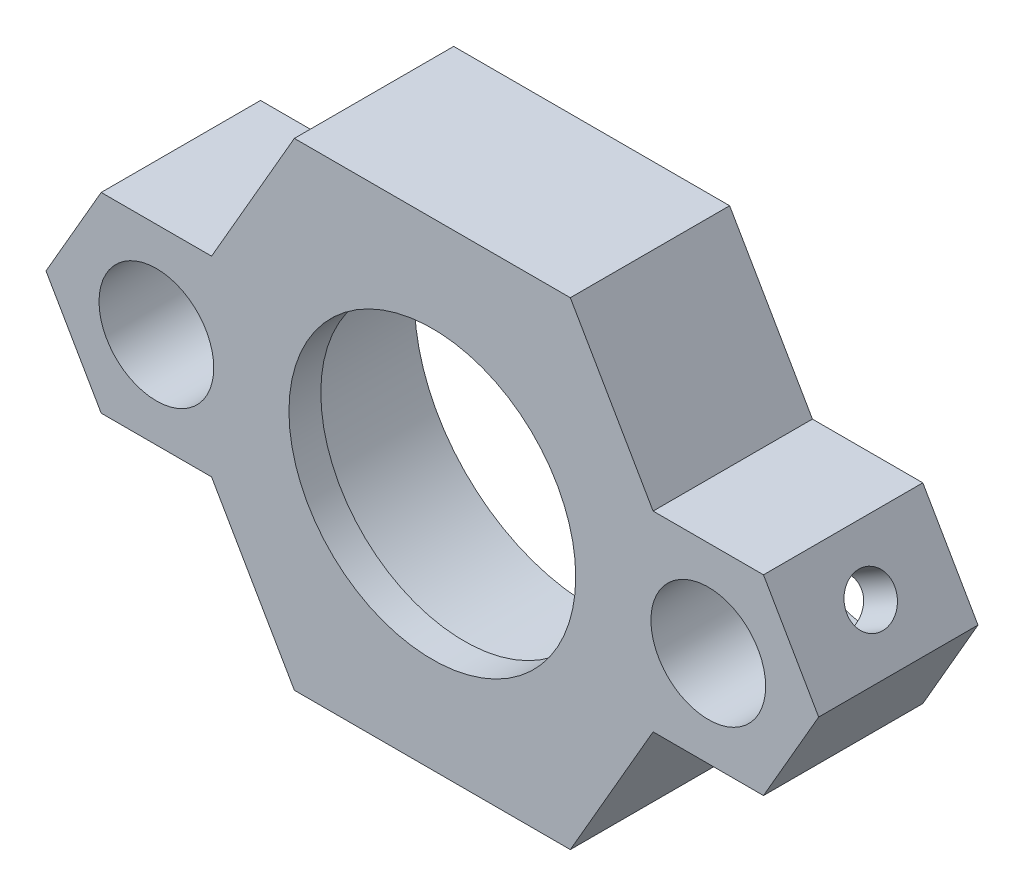
ISO-10303-21;
HEADER;
FILE_DESCRIPTION(('STEP AP214'),'2;1');
FILE_NAME('part.step','',(''),(''),'','','');
FILE_SCHEMA(('AUTOMOTIVE_DESIGN { 1 0 10303 214 1 1 1 1 }'));
ENDSEC;
DATA;
#1=APPLICATION_CONTEXT('core data for automotive mechanical design processes');
#2=APPLICATION_PROTOCOL_DEFINITION('international standard','automotive_design',2000,#1);
#3=PRODUCT_CONTEXT('',#1,'mechanical');
#4=PRODUCT('Part','Part','',(#3));
#5=PRODUCT_RELATED_PRODUCT_CATEGORY('part','',(#4));
#6=PRODUCT_DEFINITION_FORMATION('','',#4);
#7=PRODUCT_DEFINITION_CONTEXT('part definition',#1,'design');
#8=PRODUCT_DEFINITION('design','',#6,#7);
#9=PRODUCT_DEFINITION_SHAPE('','',#8);
#10=(LENGTH_UNIT() NAMED_UNIT(*) SI_UNIT(.MILLI.,.METRE.));
#11=(NAMED_UNIT(*) PLANE_ANGLE_UNIT() SI_UNIT($,.RADIAN.));
#12=(NAMED_UNIT(*) SI_UNIT($,.STERADIAN.) SOLID_ANGLE_UNIT());
#13=UNCERTAINTY_MEASURE_WITH_UNIT(LENGTH_MEASURE(1.E-05),#10,'distance_accuracy_value','');
#14=(GEOMETRIC_REPRESENTATION_CONTEXT(3) GLOBAL_UNCERTAINTY_ASSIGNED_CONTEXT((#13)) GLOBAL_UNIT_ASSIGNED_CONTEXT((#10,
#11,#12)) REPRESENTATION_CONTEXT('',''));
#15=CARTESIAN_POINT('',(0.,0.,0.));
#16=DIRECTION('',(0.,0.,1.));
#17=DIRECTION('',(1.,0.,0.));
#18=AXIS2_PLACEMENT_3D('',#15,#16,#17);
#19=CARTESIAN_POINT('',(0.,0.,0.));
#20=DIRECTION('',(0.,0.,1.));
#21=DIRECTION('',(1.,0.,0.));
#22=AXIS2_PLACEMENT_3D('',#19,#20,#21);
#23=PLANE('',#22);
#24=DIRECTION('',(-0.500000000000001,0.866025403784438,0.));
#25=VECTOR('',#24,1.);
#26=CARTESIAN_POINT('',(13.856406460551,5.99999999999999,0.));
#27=LINE('',#26,#25);
#28=CARTESIAN_POINT('',(13.856406460551,5.99999999999999,0.));
#29=VERTEX_POINT('',#28);
#30=CARTESIAN_POINT('',(8.66025403784438,15.,0.));
#31=VERTEX_POINT('',#30);
#32=EDGE_CURVE('E214',#29,#31,#27,.T.);
#33=ORIENTED_EDGE('',*,*,#32,.F.);
#34=DIRECTION('',(-1.,0.,0.));
#35=VECTOR('',#34,1.);
#36=CARTESIAN_POINT('',(20.7846096908265,5.99999999999999,0.));
#37=LINE('',#36,#35);
#38=CARTESIAN_POINT('',(20.7846096908265,5.99999999999999,0.));
#39=VERTEX_POINT('',#38);
#40=EDGE_CURVE('E54',#39,#29,#37,.T.);
#41=ORIENTED_EDGE('',*,*,#40,.F.);
#42=DIRECTION('',(-0.499999999999999,0.866025403784439,0.));
#43=VECTOR('',#42,1.);
#44=CARTESIAN_POINT('',(24.2487113059643,0.,0.));
#45=LINE('',#44,#43);
#46=CARTESIAN_POINT('',(24.2487113059643,0.,0.));
#47=VERTEX_POINT('',#46);
#48=EDGE_CURVE('E62',#47,#39,#45,.T.);
#49=ORIENTED_EDGE('',*,*,#48,.F.);
#50=DIRECTION('',(0.5,0.866025403784438,0.));
#51=VECTOR('',#50,1.);
#52=CARTESIAN_POINT('',(20.7846096908265,-6.00000000000001,0.));
#53=LINE('',#52,#51);
#54=CARTESIAN_POINT('',(20.7846096908265,-6.00000000000001,0.));
#55=VERTEX_POINT('',#54);
#56=EDGE_CURVE('E236',#55,#47,#53,.T.);
#57=ORIENTED_EDGE('',*,*,#56,.F.);
#58=DIRECTION('',(1.,0.,0.));
#59=VECTOR('',#58,1.);
#60=CARTESIAN_POINT('',(13.856406460551,-6.00000000000001,0.));
#61=LINE('',#60,#59);
#62=CARTESIAN_POINT('',(13.856406460551,-6.00000000000001,0.));
#63=VERTEX_POINT('',#62);
#64=EDGE_CURVE('E234',#63,#55,#61,.T.);
#65=ORIENTED_EDGE('',*,*,#64,.F.);
#66=DIRECTION('',(0.5,0.866025403784438,0.));
#67=VECTOR('',#66,1.);
#68=CARTESIAN_POINT('',(8.66025403784438,-15.,0.));
#69=LINE('',#68,#67);
#70=CARTESIAN_POINT('',(8.66025403784438,-15.,0.));
#71=VERTEX_POINT('',#70);
#72=EDGE_CURVE('E232',#71,#63,#69,.T.);
#73=ORIENTED_EDGE('',*,*,#72,.F.);
#74=DIRECTION('',(1.,0.,0.));
#75=VECTOR('',#74,1.);
#76=CARTESIAN_POINT('',(-8.66025403784438,-15.,0.));
#77=LINE('',#76,#75);
#78=CARTESIAN_POINT('',(-8.66025403784438,-15.,0.));
#79=VERTEX_POINT('',#78);
#80=EDGE_CURVE('E230',#79,#71,#77,.T.);
#81=ORIENTED_EDGE('',*,*,#80,.F.);
#82=DIRECTION('',(0.5,-0.866025403784439,0.));
#83=VECTOR('',#82,1.);
#84=CARTESIAN_POINT('',(-13.856406460551,-6.00000000000001,0.));
#85=LINE('',#84,#83);
#86=CARTESIAN_POINT('',(-13.856406460551,-6.00000000000001,0.));
#87=VERTEX_POINT('',#86);
#88=EDGE_CURVE('E228',#87,#79,#85,.T.);
#89=ORIENTED_EDGE('',*,*,#88,.F.);
#90=DIRECTION('',(1.,0.,0.));
#91=VECTOR('',#90,1.);
#92=CARTESIAN_POINT('',(-13.856406460551,-6.00000000000001,0.));
#93=LINE('',#92,#91);
#94=CARTESIAN_POINT('',(-20.7846096908265,-6.00000000000001,0.));
#95=VERTEX_POINT('',#94);
#96=EDGE_CURVE('E226',#95,#87,#93,.T.);
#97=ORIENTED_EDGE('',*,*,#96,.F.);
#98=DIRECTION('',(0.5,-0.866025403784438,0.));
#99=VECTOR('',#98,1.);
#100=CARTESIAN_POINT('',(-20.7846096908265,-6.00000000000001,0.));
#101=LINE('',#100,#99);
#102=CARTESIAN_POINT('',(-24.2487113059643,0.,0.));
#103=VERTEX_POINT('',#102);
#104=EDGE_CURVE('E224',#103,#95,#101,.T.);
#105=ORIENTED_EDGE('',*,*,#104,.F.);
#106=DIRECTION('',(-0.499999999999999,-0.866025403784439,0.));
#107=VECTOR('',#106,1.);
#108=CARTESIAN_POINT('',(-24.2487113059643,0.,0.));
#109=LINE('',#108,#107);
#110=CARTESIAN_POINT('',(-20.7846096908265,5.99999999999999,0.));
#111=VERTEX_POINT('',#110);
#112=EDGE_CURVE('E222',#111,#103,#109,.T.);
#113=ORIENTED_EDGE('',*,*,#112,.F.);
#114=DIRECTION('',(-1.,0.,0.));
#115=VECTOR('',#114,1.);
#116=CARTESIAN_POINT('',(-20.7846096908265,5.99999999999999,0.));
#117=LINE('',#116,#115);
#118=CARTESIAN_POINT('',(-13.856406460551,5.99999999999999,0.));
#119=VERTEX_POINT('',#118);
#120=EDGE_CURVE('E220',#119,#111,#117,.T.);
#121=ORIENTED_EDGE('',*,*,#120,.F.);
#122=DIRECTION('',(-0.5,-0.866025403784438,0.));
#123=VECTOR('',#122,1.);
#124=CARTESIAN_POINT('',(-8.66025403784438,15.,0.));
#125=LINE('',#124,#123);
#126=CARTESIAN_POINT('',(-8.66025403784438,15.,0.));
#127=VERTEX_POINT('',#126);
#128=EDGE_CURVE('E218',#127,#119,#125,.T.);
#129=ORIENTED_EDGE('',*,*,#128,.F.);
#130=DIRECTION('',(-1.,0.,0.));
#131=VECTOR('',#130,1.);
#132=CARTESIAN_POINT('',(8.66025403784438,15.,0.));
#133=LINE('',#132,#131);
#134=EDGE_CURVE('E145',#31,#127,#133,.T.);
#135=ORIENTED_EDGE('',*,*,#134,.F.);
#136=EDGE_LOOP('',(#33,#41,#49,#57,#65,#73,#81,#89,#97,#105,#113,#121,#129,#135));
#137=FACE_BOUND('',#136,.T.);
#138=CARTESIAN_POINT('',(0.,0.,0.));
#139=DIRECTION('',(0.,0.,1.));
#140=DIRECTION('',(1.,0.,0.));
#141=AXIS2_PLACEMENT_3D('',#138,#139,#140);
#142=CIRCLE('',#141,11.125);
#143=CARTESIAN_POINT('',(11.125,0.,0.));
#144=VERTEX_POINT('',#143);
#145=EDGE_CURVE('E209',#144,#144,#142,.T.);
#146=ORIENTED_EDGE('',*,*,#145,.T.);
#147=EDGE_LOOP('',(#146));
#148=FACE_BOUND('',#147,.T.);
#149=CARTESIAN_POINT('',(17.3205080756888,0.,0.));
#150=DIRECTION('',(0.,0.,1.));
#151=DIRECTION('',(1.,0.,0.));
#152=AXIS2_PLACEMENT_3D('',#149,#150,#151);
#153=CIRCLE('',#152,3.6);
#154=CARTESIAN_POINT('',(20.9205080756888,0.,0.));
#155=VERTEX_POINT('',#154);
#156=EDGE_CURVE('E206',#155,#155,#153,.T.);
#157=ORIENTED_EDGE('',*,*,#156,.T.);
#158=EDGE_LOOP('',(#157));
#159=FACE_BOUND('',#158,.T.);
#160=CARTESIAN_POINT('',(-17.3205080756888,0.,0.));
#161=DIRECTION('',(0.,0.,1.));
#162=DIRECTION('',(-1.,0.,0.));
#163=AXIS2_PLACEMENT_3D('',#160,#161,#162);
#164=CIRCLE('',#163,3.6);
#165=CARTESIAN_POINT('',(-20.9205080756888,0.,0.));
#166=VERTEX_POINT('',#165);
#167=EDGE_CURVE('E203',#166,#166,#164,.T.);
#168=ORIENTED_EDGE('',*,*,#167,.T.);
#169=EDGE_LOOP('',(#168));
#170=FACE_BOUND('',#169,.T.);
#171=ADVANCED_FACE('F39',(#137,#148,#159,#170),#23,.F.);
#172=CARTESIAN_POINT('',(13.856406460551,5.99999999999999,8.));
#173=DIRECTION('',(-0.866025403784438,-0.500000000000001,0.));
#174=DIRECTION('',(0.500000000000001,-0.866025403784438,0.));
#175=AXIS2_PLACEMENT_3D('',#172,#173,#174);
#176=PLANE('',#175);
#177=ORIENTED_EDGE('',*,*,#32,.T.);
#178=DIRECTION('',(0.,0.,-1.));
#179=VECTOR('',#178,1.);
#180=CARTESIAN_POINT('',(8.66025403784438,15.,8.));
#181=LINE('',#180,#179);
#182=CARTESIAN_POINT('',(8.66025403784438,15.,10.));
#183=VERTEX_POINT('',#182);
#184=EDGE_CURVE('E11',#183,#31,#181,.T.);
#185=ORIENTED_EDGE('',*,*,#184,.F.);
#186=DIRECTION('',(-0.500000000000001,0.866025403784438,0.));
#187=VECTOR('',#186,1.);
#188=CARTESIAN_POINT('',(13.856406460551,5.99999999999999,10.));
#189=LINE('',#188,#187);
#190=CARTESIAN_POINT('',(13.856406460551,5.99999999999999,10.));
#191=VERTEX_POINT('',#190);
#192=EDGE_CURVE('E163',#191,#183,#189,.T.);
#193=ORIENTED_EDGE('',*,*,#192,.F.);
#194=DIRECTION('',(0.,0.,-1.));
#195=VECTOR('',#194,1.);
#196=CARTESIAN_POINT('',(13.856406460551,5.99999999999999,8.));
#197=LINE('',#196,#195);
#198=EDGE_CURVE('E240',#191,#29,#197,.T.);
#199=ORIENTED_EDGE('',*,*,#198,.T.);
#200=EDGE_LOOP('',(#177,#185,#193,#199));
#201=FACE_BOUND('',#200,.T.);
#202=ADVANCED_FACE('F41',(#201),#176,.F.);
#203=CARTESIAN_POINT('',(8.66025403784438,15.,8.));
#204=DIRECTION('',(0.,-1.,0.));
#205=DIRECTION('',(0.,0.,-1.));
#206=AXIS2_PLACEMENT_3D('',#203,#204,#205);
#207=PLANE('',#206);
#208=ORIENTED_EDGE('',*,*,#134,.T.);
#209=DIRECTION('',(0.,0.,-1.));
#210=VECTOR('',#209,1.);
#211=CARTESIAN_POINT('',(-8.66025403784438,15.,8.));
#212=LINE('',#211,#210);
#213=CARTESIAN_POINT('',(-8.66025403784438,15.,10.));
#214=VERTEX_POINT('',#213);
#215=EDGE_CURVE('E47',#214,#127,#212,.T.);
#216=ORIENTED_EDGE('',*,*,#215,.F.);
#217=DIRECTION('',(-1.,0.,0.));
#218=VECTOR('',#217,1.);
#219=CARTESIAN_POINT('',(8.66025403784438,15.,10.));
#220=LINE('',#219,#218);
#221=EDGE_CURVE('E144',#183,#214,#220,.T.);
#222=ORIENTED_EDGE('',*,*,#221,.F.);
#223=ORIENTED_EDGE('',*,*,#184,.T.);
#224=EDGE_LOOP('',(#208,#216,#222,#223));
#225=FACE_BOUND('',#224,.T.);
#226=ADVANCED_FACE('F142',(#225),#207,.F.);
#227=CARTESIAN_POINT('',(-8.66025403784438,15.,8.));
#228=DIRECTION('',(0.866025403784439,-0.5,0.));
#229=DIRECTION('',(0.5,0.866025403784438,0.));
#230=AXIS2_PLACEMENT_3D('',#227,#228,#229);
#231=PLANE('',#230);
#232=ORIENTED_EDGE('',*,*,#128,.T.);
#233=DIRECTION('',(0.,0.,-1.));
#234=VECTOR('',#233,1.);
#235=CARTESIAN_POINT('',(-13.856406460551,5.99999999999999,8.));
#236=LINE('',#235,#234);
#237=CARTESIAN_POINT('',(-13.856406460551,5.99999999999999,10.));
#238=VERTEX_POINT('',#237);
#239=EDGE_CURVE('E148',#238,#119,#236,.T.);
#240=ORIENTED_EDGE('',*,*,#239,.F.);
#241=DIRECTION('',(-0.5,-0.866025403784438,0.));
#242=VECTOR('',#241,1.);
#243=CARTESIAN_POINT('',(-8.66025403784438,15.,10.));
#244=LINE('',#243,#242);
#245=EDGE_CURVE('E150',#214,#238,#244,.T.);
#246=ORIENTED_EDGE('',*,*,#245,.F.);
#247=ORIENTED_EDGE('',*,*,#215,.T.);
#248=EDGE_LOOP('',(#232,#240,#246,#247));
#249=FACE_BOUND('',#248,.T.);
#250=ADVANCED_FACE('F151',(#249),#231,.F.);
#251=CARTESIAN_POINT('',(-20.7846096908265,5.99999999999999,8.));
#252=DIRECTION('',(0.,-1.,0.));
#253=DIRECTION('',(1.,0.,0.));
#254=AXIS2_PLACEMENT_3D('',#251,#252,#253);
#255=PLANE('',#254);
#256=ORIENTED_EDGE('',*,*,#120,.T.);
#257=DIRECTION('',(0.,0.,-1.));
#258=VECTOR('',#257,1.);
#259=CARTESIAN_POINT('',(-20.7846096908265,5.99999999999999,8.));
#260=LINE('',#259,#258);
#261=CARTESIAN_POINT('',(-20.7846096908265,5.99999999999999,10.));
#262=VERTEX_POINT('',#261);
#263=EDGE_CURVE('E267',#262,#111,#260,.T.);
#264=ORIENTED_EDGE('',*,*,#263,.F.);
#265=DIRECTION('',(-1.,0.,0.));
#266=VECTOR('',#265,1.);
#267=CARTESIAN_POINT('',(-13.856406460551,5.99999999999999,10.));
#268=LINE('',#267,#266);
#269=EDGE_CURVE('E156',#238,#262,#268,.T.);
#270=ORIENTED_EDGE('',*,*,#269,.F.);
#271=ORIENTED_EDGE('',*,*,#239,.T.);
#272=EDGE_LOOP('',(#256,#264,#270,#271));
#273=FACE_BOUND('',#272,.T.);
#274=ADVANCED_FACE('F272',(#273),#255,.F.);
#275=CARTESIAN_POINT('',(-24.2487113059643,0.,8.));
#276=DIRECTION('',(0.866025403784439,-0.499999999999999,0.));
#277=DIRECTION('',(0.499999999999999,0.866025403784439,0.));
#278=AXIS2_PLACEMENT_3D('',#275,#276,#277);
#279=PLANE('',#278);
#280=CARTESIAN_POINT('',(-22.5166604983954,2.99999999999999,5.));
#281=DIRECTION('',(-0.866025403784439,0.499999999999999,0.));
#282=DIRECTION('',(-0.499999999999999,-0.866025403784439,0.));
#283=AXIS2_PLACEMENT_3D('',#280,#281,#282);
#284=CIRCLE('',#283,1.5);
#285=CARTESIAN_POINT('',(-23.2666604983954,1.70096189432334,5.));
#286=VERTEX_POINT('',#285);
#287=EDGE_CURVE('E369',#286,#286,#284,.T.);
#288=ORIENTED_EDGE('',*,*,#287,.F.);
#289=EDGE_LOOP('',(#288));
#290=FACE_BOUND('',#289,.T.);
#291=ORIENTED_EDGE('',*,*,#112,.T.);
#292=DIRECTION('',(0.,0.,-1.));
#293=VECTOR('',#292,1.);
#294=CARTESIAN_POINT('',(-24.2487113059643,0.,8.));
#295=LINE('',#294,#293);
#296=CARTESIAN_POINT('',(-24.2487113059643,0.,10.));
#297=VERTEX_POINT('',#296);
#298=EDGE_CURVE('E264',#297,#103,#295,.T.);
#299=ORIENTED_EDGE('',*,*,#298,.F.);
#300=DIRECTION('',(-0.499999999999999,-0.866025403784439,0.));
#301=VECTOR('',#300,1.);
#302=CARTESIAN_POINT('',(-20.7846096908265,5.99999999999999,10.));
#303=LINE('',#302,#301);
#304=EDGE_CURVE('E172',#262,#297,#303,.T.);
#305=ORIENTED_EDGE('',*,*,#304,.F.);
#306=ORIENTED_EDGE('',*,*,#263,.T.);
#307=EDGE_LOOP('',(#291,#299,#305,#306));
#308=FACE_BOUND('',#307,.T.);
#309=ADVANCED_FACE('F280',(#290,#308),#279,.F.);
#310=CARTESIAN_POINT('',(-20.7846096908265,-6.00000000000001,8.));
#311=DIRECTION('',(0.866025403784438,0.5,0.));
#312=DIRECTION('',(-0.5,0.866025403784438,0.));
#313=AXIS2_PLACEMENT_3D('',#310,#311,#312);
#314=PLANE('',#313);
#315=ORIENTED_EDGE('',*,*,#104,.T.);
#316=DIRECTION('',(0.,0.,-1.));
#317=VECTOR('',#316,1.);
#318=CARTESIAN_POINT('',(-20.7846096908265,-6.00000000000001,8.));
#319=LINE('',#318,#317);
#320=CARTESIAN_POINT('',(-20.7846096908265,-6.00000000000001,10.));
#321=VERTEX_POINT('',#320);
#322=EDGE_CURVE('E261',#321,#95,#319,.T.);
#323=ORIENTED_EDGE('',*,*,#322,.F.);
#324=DIRECTION('',(0.5,-0.866025403784438,0.));
#325=VECTOR('',#324,1.);
#326=CARTESIAN_POINT('',(-24.2487113059643,0.,10.));
#327=LINE('',#326,#325);
#328=EDGE_CURVE('E175',#297,#321,#327,.T.);
#329=ORIENTED_EDGE('',*,*,#328,.F.);
#330=ORIENTED_EDGE('',*,*,#298,.T.);
#331=EDGE_LOOP('',(#315,#323,#329,#330));
#332=FACE_BOUND('',#331,.T.);
#333=ADVANCED_FACE('F284',(#332),#314,.F.);
#334=CARTESIAN_POINT('',(-13.856406460551,-6.00000000000001,8.));
#335=DIRECTION('',(0.,1.,0.));
#336=DIRECTION('',(-1.,0.,0.));
#337=AXIS2_PLACEMENT_3D('',#334,#335,#336);
#338=PLANE('',#337);
#339=ORIENTED_EDGE('',*,*,#96,.T.);
#340=DIRECTION('',(0.,0.,-1.));
#341=VECTOR('',#340,1.);
#342=CARTESIAN_POINT('',(-13.856406460551,-6.00000000000001,8.));
#343=LINE('',#342,#341);
#344=CARTESIAN_POINT('',(-13.856406460551,-6.00000000000001,10.));
#345=VERTEX_POINT('',#344);
#346=EDGE_CURVE('E258',#345,#87,#343,.T.);
#347=ORIENTED_EDGE('',*,*,#346,.F.);
#348=DIRECTION('',(1.,0.,0.));
#349=VECTOR('',#348,1.);
#350=CARTESIAN_POINT('',(-20.7846096908265,-6.00000000000001,10.));
#351=LINE('',#350,#349);
#352=EDGE_CURVE('E178',#321,#345,#351,.T.);
#353=ORIENTED_EDGE('',*,*,#352,.F.);
#354=ORIENTED_EDGE('',*,*,#322,.T.);
#355=EDGE_LOOP('',(#339,#347,#353,#354));
#356=FACE_BOUND('',#355,.T.);
#357=ADVANCED_FACE('F288',(#356),#338,.F.);
#358=CARTESIAN_POINT('',(-13.856406460551,-6.00000000000001,8.));
#359=DIRECTION('',(0.866025403784439,0.5,0.));
#360=DIRECTION('',(-0.5,0.866025403784439,0.));
#361=AXIS2_PLACEMENT_3D('',#358,#359,#360);
#362=PLANE('',#361);
#363=ORIENTED_EDGE('',*,*,#88,.T.);
#364=DIRECTION('',(0.,0.,-1.));
#365=VECTOR('',#364,1.);
#366=CARTESIAN_POINT('',(-8.66025403784438,-15.,8.));
#367=LINE('',#366,#365);
#368=CARTESIAN_POINT('',(-8.66025403784438,-15.,10.));
#369=VERTEX_POINT('',#368);
#370=EDGE_CURVE('E255',#369,#79,#367,.T.);
#371=ORIENTED_EDGE('',*,*,#370,.F.);
#372=DIRECTION('',(0.5,-0.866025403784439,0.));
#373=VECTOR('',#372,1.);
#374=CARTESIAN_POINT('',(-13.856406460551,-6.00000000000001,10.));
#375=LINE('',#374,#373);
#376=EDGE_CURVE('E181',#345,#369,#375,.T.);
#377=ORIENTED_EDGE('',*,*,#376,.F.);
#378=ORIENTED_EDGE('',*,*,#346,.T.);
#379=EDGE_LOOP('',(#363,#371,#377,#378));
#380=FACE_BOUND('',#379,.T.);
#381=ADVANCED_FACE('F291',(#380),#362,.F.);
#382=CARTESIAN_POINT('',(-8.66025403784438,-15.,8.));
#383=DIRECTION('',(0.,1.,0.));
#384=DIRECTION('',(-1.,0.,0.));
#385=AXIS2_PLACEMENT_3D('',#382,#383,#384);
#386=PLANE('',#385);
#387=ORIENTED_EDGE('',*,*,#80,.T.);
#388=DIRECTION('',(0.,0.,-1.));
#389=VECTOR('',#388,1.);
#390=CARTESIAN_POINT('',(8.66025403784438,-15.,8.));
#391=LINE('',#390,#389);
#392=CARTESIAN_POINT('',(8.66025403784438,-15.,10.));
#393=VERTEX_POINT('',#392);
#394=EDGE_CURVE('E252',#393,#71,#391,.T.);
#395=ORIENTED_EDGE('',*,*,#394,.F.);
#396=DIRECTION('',(1.,0.,0.));
#397=VECTOR('',#396,1.);
#398=CARTESIAN_POINT('',(-8.66025403784438,-15.,10.));
#399=LINE('',#398,#397);
#400=EDGE_CURVE('E184',#369,#393,#399,.T.);
#401=ORIENTED_EDGE('',*,*,#400,.F.);
#402=ORIENTED_EDGE('',*,*,#370,.T.);
#403=EDGE_LOOP('',(#387,#395,#401,#402));
#404=FACE_BOUND('',#403,.T.);
#405=ADVANCED_FACE('F296',(#404),#386,.F.);
#406=CARTESIAN_POINT('',(8.66025403784438,-15.,8.));
#407=DIRECTION('',(-0.866025403784438,0.5,0.));
#408=DIRECTION('',(-0.5,-0.866025403784439,0.));
#409=AXIS2_PLACEMENT_3D('',#406,#407,#408);
#410=PLANE('',#409);
#411=ORIENTED_EDGE('',*,*,#72,.T.);
#412=DIRECTION('',(0.,0.,-1.));
#413=VECTOR('',#412,1.);
#414=CARTESIAN_POINT('',(13.856406460551,-6.00000000000001,8.));
#415=LINE('',#414,#413);
#416=CARTESIAN_POINT('',(13.856406460551,-6.00000000000001,10.));
#417=VERTEX_POINT('',#416);
#418=EDGE_CURVE('E249',#417,#63,#415,.T.);
#419=ORIENTED_EDGE('',*,*,#418,.F.);
#420=DIRECTION('',(0.5,0.866025403784438,0.));
#421=VECTOR('',#420,1.);
#422=CARTESIAN_POINT('',(8.66025403784438,-15.,10.));
#423=LINE('',#422,#421);
#424=EDGE_CURVE('E187',#393,#417,#423,.T.);
#425=ORIENTED_EDGE('',*,*,#424,.F.);
#426=ORIENTED_EDGE('',*,*,#394,.T.);
#427=EDGE_LOOP('',(#411,#419,#425,#426));
#428=FACE_BOUND('',#427,.T.);
#429=ADVANCED_FACE('F300',(#428),#410,.F.);
#430=CARTESIAN_POINT('',(13.856406460551,-6.00000000000001,8.));
#431=DIRECTION('',(0.,1.,0.));
#432=DIRECTION('',(-1.,0.,0.));
#433=AXIS2_PLACEMENT_3D('',#430,#431,#432);
#434=PLANE('',#433);
#435=ORIENTED_EDGE('',*,*,#64,.T.);
#436=DIRECTION('',(0.,0.,-1.));
#437=VECTOR('',#436,1.);
#438=CARTESIAN_POINT('',(20.7846096908265,-6.00000000000001,8.));
#439=LINE('',#438,#437);
#440=CARTESIAN_POINT('',(20.7846096908265,-6.00000000000001,10.));
#441=VERTEX_POINT('',#440);
#442=EDGE_CURVE('E246',#441,#55,#439,.T.);
#443=ORIENTED_EDGE('',*,*,#442,.F.);
#444=DIRECTION('',(1.,0.,0.));
#445=VECTOR('',#444,1.);
#446=CARTESIAN_POINT('',(13.856406460551,-6.00000000000001,10.));
#447=LINE('',#446,#445);
#448=EDGE_CURVE('E190',#417,#441,#447,.T.);
#449=ORIENTED_EDGE('',*,*,#448,.F.);
#450=ORIENTED_EDGE('',*,*,#418,.T.);
#451=EDGE_LOOP('',(#435,#443,#449,#450));
#452=FACE_BOUND('',#451,.T.);
#453=ADVANCED_FACE('F304',(#452),#434,.F.);
#454=CARTESIAN_POINT('',(20.7846096908265,-6.00000000000001,8.));
#455=DIRECTION('',(-0.866025403784438,0.5,0.));
#456=DIRECTION('',(-0.5,-0.866025403784438,0.));
#457=AXIS2_PLACEMENT_3D('',#454,#455,#456);
#458=PLANE('',#457);
#459=ORIENTED_EDGE('',*,*,#56,.T.);
#460=DIRECTION('',(0.,0.,-1.));
#461=VECTOR('',#460,1.);
#462=CARTESIAN_POINT('',(24.2487113059643,0.,8.));
#463=LINE('',#462,#461);
#464=CARTESIAN_POINT('',(24.2487113059643,0.,10.));
#465=VERTEX_POINT('',#464);
#466=EDGE_CURVE('E244',#465,#47,#463,.T.);
#467=ORIENTED_EDGE('',*,*,#466,.F.);
#468=DIRECTION('',(0.5,0.866025403784438,0.));
#469=VECTOR('',#468,1.);
#470=CARTESIAN_POINT('',(20.7846096908265,-6.00000000000001,10.));
#471=LINE('',#470,#469);
#472=EDGE_CURVE('E193',#441,#465,#471,.T.);
#473=ORIENTED_EDGE('',*,*,#472,.F.);
#474=ORIENTED_EDGE('',*,*,#442,.T.);
#475=EDGE_LOOP('',(#459,#467,#473,#474));
#476=FACE_BOUND('',#475,.T.);
#477=ADVANCED_FACE('F307',(#476),#458,.F.);
#478=CARTESIAN_POINT('',(24.2487113059643,0.,8.));
#479=DIRECTION('',(-0.866025403784439,-0.499999999999999,0.));
#480=DIRECTION('',(0.499999999999999,-0.866025403784439,0.));
#481=AXIS2_PLACEMENT_3D('',#478,#479,#480);
#482=PLANE('',#481);
#483=CARTESIAN_POINT('',(22.5166604983954,2.99999999999999,5.));
#484=DIRECTION('',(0.866025403784439,0.499999999999999,0.));
#485=DIRECTION('',(-0.499999999999999,0.866025403784439,0.));
#486=AXIS2_PLACEMENT_3D('',#483,#484,#485);
#487=CIRCLE('',#486,1.5);
#488=CARTESIAN_POINT('',(21.7666604983954,4.29903810567665,5.));
#489=VERTEX_POINT('',#488);
#490=EDGE_CURVE('E401',#489,#489,#487,.T.);
#491=ORIENTED_EDGE('',*,*,#490,.F.);
#492=EDGE_LOOP('',(#491));
#493=FACE_BOUND('',#492,.T.);
#494=ORIENTED_EDGE('',*,*,#48,.T.);
#495=DIRECTION('',(0.,0.,-1.));
#496=VECTOR('',#495,1.);
#497=CARTESIAN_POINT('',(20.7846096908265,5.99999999999999,8.));
#498=LINE('',#497,#496);
#499=CARTESIAN_POINT('',(20.7846096908265,5.99999999999999,10.));
#500=VERTEX_POINT('',#499);
#501=EDGE_CURVE('E242',#500,#39,#498,.T.);
#502=ORIENTED_EDGE('',*,*,#501,.F.);
#503=DIRECTION('',(-0.499999999999999,0.866025403784439,0.));
#504=VECTOR('',#503,1.);
#505=CARTESIAN_POINT('',(24.2487113059643,0.,10.));
#506=LINE('',#505,#504);
#507=EDGE_CURVE('E196',#465,#500,#506,.T.);
#508=ORIENTED_EDGE('',*,*,#507,.F.);
#509=ORIENTED_EDGE('',*,*,#466,.T.);
#510=EDGE_LOOP('',(#494,#502,#508,#509));
#511=FACE_BOUND('',#510,.T.);
#512=ADVANCED_FACE('F312',(#493,#511),#482,.F.);
#513=CARTESIAN_POINT('',(20.7846096908265,5.99999999999999,8.));
#514=DIRECTION('',(0.,-1.,0.));
#515=DIRECTION('',(1.,0.,0.));
#516=AXIS2_PLACEMENT_3D('',#513,#514,#515);
#517=PLANE('',#516);
#518=ORIENTED_EDGE('',*,*,#40,.T.);
#519=ORIENTED_EDGE('',*,*,#198,.F.);
#520=DIRECTION('',(-1.,0.,0.));
#521=VECTOR('',#520,1.);
#522=CARTESIAN_POINT('',(20.7846096908265,5.99999999999999,10.));
#523=LINE('',#522,#521);
#524=EDGE_CURVE('E199',#500,#191,#523,.T.);
#525=ORIENTED_EDGE('',*,*,#524,.F.);
#526=ORIENTED_EDGE('',*,*,#501,.T.);
#527=EDGE_LOOP('',(#518,#519,#525,#526));
#528=FACE_BOUND('',#527,.T.);
#529=ADVANCED_FACE('F310',(#528),#517,.F.);
#530=CARTESIAN_POINT('',(0.,0.,8.));
#531=DIRECTION('',(0.,0.,-1.));
#532=DIRECTION('',(-1.,0.,0.));
#533=AXIS2_PLACEMENT_3D('',#530,#531,#532);
#534=CYLINDRICAL_SURFACE('',#533,11.125);
#535=CARTESIAN_POINT('',(0.,0.,8.));
#536=DIRECTION('',(0.,0.,1.));
#537=DIRECTION('',(1.,0.,0.));
#538=AXIS2_PLACEMENT_3D('',#535,#536,#537);
#539=CIRCLE('',#538,11.125);
#540=CARTESIAN_POINT('',(11.125,0.,8.));
#541=VERTEX_POINT('',#540);
#542=EDGE_CURVE('E202',#541,#541,#539,.T.);
#543=ORIENTED_EDGE('',*,*,#542,.T.);
#544=EDGE_LOOP('',(#543));
#545=FACE_BOUND('',#544,.T.);
#546=ORIENTED_EDGE('',*,*,#145,.F.);
#547=EDGE_LOOP('',(#546));
#548=FACE_BOUND('',#547,.T.);
#549=ADVANCED_FACE('F321',(#545,#548),#534,.F.);
#550=CARTESIAN_POINT('',(17.3205080756888,0.,8.));
#551=DIRECTION('',(0.,0.,-1.));
#552=DIRECTION('',(-1.,0.,0.));
#553=AXIS2_PLACEMENT_3D('',#550,#551,#552);
#554=CYLINDRICAL_SURFACE('',#553,3.6);
#555=CARTESIAN_POINT('',(19.4046746198424,2.93534492287201,5.));
#556=CARTESIAN_POINT('',(19.4046865135801,2.93534152304987,5.08000626907623));
#557=CARTESIAN_POINT('',(19.4104732770715,2.9312547139798,5.16014318819146));
#558=CARTESIAN_POINT('',(19.4331699857263,2.91493424022066,5.31810433046857));
#559=CARTESIAN_POINT('',(19.4501101358762,2.90267845163436,5.39592167201029));
#560=CARTESIAN_POINT('',(19.493680940087,2.87020020702673,5.54667335562929));
#561=CARTESIAN_POINT('',(19.5202720720512,2.85001021514226,5.61962619645802));
#562=CARTESIAN_POINT('',(19.5813534885536,2.80180044243818,5.75931133949366));
#563=CARTESIAN_POINT('',(19.6158419042961,2.77378251365932,5.82604510811975));
#564=CARTESIAN_POINT('',(19.692917824325,2.70820408186695,5.95559086996817));
#565=CARTESIAN_POINT('',(19.7358525311344,2.67019431928779,6.01796907049291));
#566=CARTESIAN_POINT('',(19.8261431952515,2.58565575662187,6.13304026699707));
#567=CARTESIAN_POINT('',(19.8735008466593,2.53912368566198,6.18572952873562));
#568=CARTESIAN_POINT('',(19.9725019113497,2.43562484561053,6.28213943705514));
#569=CARTESIAN_POINT('',(20.0242421211449,2.37829302252327,6.32537195363882));
#570=CARTESIAN_POINT('',(20.1275346219379,2.25544388354407,6.39833122460673));
#571=CARTESIAN_POINT('',(20.1790869862492,2.18993021779625,6.42806397435706));
#572=CARTESIAN_POINT('',(20.2769282096657,2.05575062444912,6.47160735050809));
#573=CARTESIAN_POINT('',(20.323351369522,1.98742615497259,6.48616603388246));
#574=CARTESIAN_POINT('',(20.4119386782969,1.84660901487839,6.50136516939183));
#575=CARTESIAN_POINT('',(20.4541045478507,1.77411804694124,6.50201126705955));
#576=CARTESIAN_POINT('',(20.5303872711503,1.63180924649574,6.48975886288002));
#577=CARTESIAN_POINT('',(20.5648378053735,1.56209722324766,6.47768227936913));
#578=CARTESIAN_POINT('',(20.6281323800366,1.42318305452728,6.44173627683421));
#579=CARTESIAN_POINT('',(20.6569760069479,1.35398094702486,6.4178659884438));
#580=CARTESIAN_POINT('',(20.7093291875305,1.21710611446473,6.35872635092643));
#581=CARTESIAN_POINT('',(20.7327506461856,1.14947283117609,6.32328864455501));
#582=CARTESIAN_POINT('',(20.774021994892,1.01879556304895,6.24218509195959));
#583=CARTESIAN_POINT('',(20.7918699105334,0.955753210583621,6.19651563098602));
#584=CARTESIAN_POINT('',(20.823710073882,0.831836920601941,6.09250109551446));
#585=CARTESIAN_POINT('',(20.8373418615131,0.771429065721674,6.03348945046519));
#586=CARTESIAN_POINT('',(20.8599434251563,0.660026800972247,5.9063462711521));
#587=CARTESIAN_POINT('',(20.8689114040527,0.609036024680021,5.83821123404949));
#588=CARTESIAN_POINT('',(20.8834934815971,0.517086946868437,5.69192595600571));
#589=CARTESIAN_POINT('',(20.8889876646683,0.476513451476064,5.61352015310806));
#590=CARTESIAN_POINT('',(20.8972512656425,0.409935330678305,5.4506227460306));
#591=CARTESIAN_POINT('',(20.9000226327991,0.383920288682649,5.36613554207654));
#592=CARTESIAN_POINT('',(20.9035549730483,0.349369828344667,5.1993238293032));
#593=CARTESIAN_POINT('',(20.9044347159527,0.33980982919393,5.11721465328914));
#594=CARTESIAN_POINT('',(20.9048306785768,0.335618024535859,4.9526258211062));
#595=CARTESIAN_POINT('',(20.9043473700233,0.340981054434473,4.87014630296995));
#596=CARTESIAN_POINT('',(20.9019313961229,0.365427997894088,4.71272193748346));
#597=CARTESIAN_POINT('',(20.9000935034919,0.383611481410619,4.63763277585584));
#598=CARTESIAN_POINT('',(20.894613691788,0.431682608437607,4.49137844420255));
#599=CARTESIAN_POINT('',(20.890971350992,0.461572987659858,4.42021419580315));
#600=CARTESIAN_POINT('',(20.8810012357871,0.533144095276258,4.28046162757224));
#601=CARTESIAN_POINT('',(20.8745662665834,0.575270533168951,4.21211003046761));
#602=CARTESIAN_POINT('',(20.8581214713199,0.668993951009579,4.08271033700117));
#603=CARTESIAN_POINT('',(20.8481100965722,0.72059502904126,4.02166541995776));
#604=CARTESIAN_POINT('',(20.8226194329421,0.836052070301954,3.90343983813919));
#605=CARTESIAN_POINT('',(20.8067613587352,0.900563706721985,3.84697832005921));
#606=CARTESIAN_POINT('',(20.7688226207233,1.03638467593549,3.74543324962481));
#607=CARTESIAN_POINT('',(20.7467415011364,1.10769450638219,3.70035053112356));
#608=CARTESIAN_POINT('',(20.6956123795089,1.25488990299471,3.62289214946771));
#609=CARTESIAN_POINT('',(20.6665466876891,1.33078671525995,3.59054931045262));
#610=CARTESIAN_POINT('',(20.601354464052,1.48424351800683,3.54005984919868));
#611=CARTESIAN_POINT('',(20.5652321505064,1.56180249035195,3.52190477812872));
#612=CARTESIAN_POINT('',(20.4893057842579,1.71031820499062,3.50137024937563));
#613=CARTESIAN_POINT('',(20.4499355671103,1.78135749507651,3.49797680036364));
#614=CARTESIAN_POINT('',(20.3667436444262,1.92015378666622,3.50433576955273));
#615=CARTESIAN_POINT('',(20.3229227205039,1.98791136141483,3.51408588321544));
#616=CARTESIAN_POINT('',(20.2340324069382,2.1159494127494,3.54572728659039));
#617=CARTESIAN_POINT('',(20.1890624478103,2.17640986423326,3.56717561656346));
#618=CARTESIAN_POINT('',(20.0981223125493,2.29133901426033,3.62112109665096));
#619=CARTESIAN_POINT('',(20.0521519479689,2.34580657200758,3.65362034559789));
#620=CARTESIAN_POINT('',(19.9589030430036,2.45030567574453,3.73038743505736));
#621=CARTESIAN_POINT('',(19.9116592740093,2.5000254949463,3.77512076170879));
#622=CARTESIAN_POINT('',(19.8200020500504,2.59166692817482,3.87440861944627));
#623=CARTESIAN_POINT('',(19.7755896541078,2.63358563546301,3.9289667964881));
#624=CARTESIAN_POINT('',(19.6887678254211,2.71201007416254,4.05073379102528));
#625=CARTESIAN_POINT('',(19.6467003302267,2.74795337555652,4.11855081754535));
#626=CARTESIAN_POINT('',(19.5706110683424,2.81060055902559,4.26255048881624));
#627=CARTESIAN_POINT('',(19.5365938015373,2.83729927744353,4.33873777766977));
#628=CARTESIAN_POINT('',(19.4792514287234,2.88116821762577,4.4971326020273));
#629=CARTESIAN_POINT('',(19.4558695528104,2.89838913637671,4.57930539055185));
#630=CARTESIAN_POINT('',(19.4216469196094,2.92330004217297,4.7474474886208));
#631=CARTESIAN_POINT('',(19.410764101873,2.93102200034131,4.83340304872916));
#632=CARTESIAN_POINT('',(19.405314260585,2.93488927741035,4.94643022911426));
#633=CARTESIAN_POINT('',(19.4046706369104,2.9353460613922,4.97320778886564));
#634=CARTESIAN_POINT('',(19.4046746198424,2.93534492287201,5.));
#635=B_SPLINE_CURVE_WITH_KNOTS('',3,(#555,#556,#557,#558,#559,#560,#561,#562,#563,#564,#565,
#566,#567,#568,#569,#570,#571,#572,#573,#574,#575,#576,#577,#578,#579,#580,#581,#582,#583,#584,
#585,#586,#587,#588,#589,#590,#591,#592,#593,#594,#595,#596,#597,#598,#599,#600,#601,#602,#603,
#604,#605,#606,#607,#608,#609,#610,#611,#612,#613,#614,#615,#616,#617,#618,#619,#620,#621,#622,
#623,#624,#625,#626,#627,#628,#629,#630,#631,#632,#633,#634),.UNSPECIFIED.,.T.,.F.,(4,2,2,2,2,2,
2,2,2,2,2,2,2,2,2,2,2,2,2,2,2,2,2,2,2,2,2,2,2,2,2,2,2,2,2,2,2,2,2,4),(0.,0.23994205438262,
0.480536594210611,0.720156782582534,0.95972032626012,1.21280209716785,1.46598120551893,
1.73014171893509,1.9941848012987,2.24448727173543,2.49468817101517,2.72966208294112,
2.96465331842261,3.20322977568079,3.44189065226981,3.69737438213381,3.9529564852964,
4.21693854800067,4.48073148894683,4.72740933967569,4.97400183022139,5.20480681279431,
5.43566576296236,5.67630152181803,5.91704160954559,6.17737995282616,6.4377373685024,
6.69876127146714,6.95962961571609,7.20226362112864,7.44485508962297,7.67884098043786,
7.91287133558608,8.15747835394845,8.40217633258686,8.66352512289693,8.92501965767027,
9.18510150956239,9.44430557455395,9.52465650524048),.UNSPECIFIED.);
#636=CARTESIAN_POINT('',(19.4046746198424,2.93534492287201,5.));
#637=VERTEX_POINT('',#636);
#638=EDGE_CURVE('E394',#637,#637,#635,.T.);
#639=ORIENTED_EDGE('',*,*,#638,.T.);
#640=EDGE_LOOP('',(#639));
#641=FACE_BOUND('',#640,.T.);
#642=ORIENTED_EDGE('',*,*,#156,.F.);
#643=EDGE_LOOP('',(#642));
#644=FACE_BOUND('',#643,.T.);
#645=CARTESIAN_POINT('',(17.3205080756888,0.,10.));
#646=DIRECTION('',(0.,0.,1.));
#647=DIRECTION('',(1.,0.,0.));
#648=AXIS2_PLACEMENT_3D('',#645,#646,#647);
#649=CIRCLE('',#648,3.6);
#650=CARTESIAN_POINT('',(20.9205080756888,0.,10.));
#651=VERTEX_POINT('',#650);
#652=EDGE_CURVE('E368',#651,#651,#649,.T.);
#653=ORIENTED_EDGE('',*,*,#652,.T.);
#654=EDGE_LOOP('',(#653));
#655=FACE_BOUND('',#654,.T.);
#656=ADVANCED_FACE('F334',(#641,#644,#655),#554,.F.);
#657=CARTESIAN_POINT('',(-17.3205080756888,0.,8.));
#658=DIRECTION('',(0.,0.,-1.));
#659=DIRECTION('',(-1.,0.,0.));
#660=AXIS2_PLACEMENT_3D('',#657,#658,#659);
#661=CYLINDRICAL_SURFACE('',#660,3.6);
#662=CARTESIAN_POINT('',(-20.9046746198425,0.337268711518703,5.));
#663=CARTESIAN_POINT('',(-20.904677622379,0.337280711708763,5.08000626907623));
#664=CARTESIAN_POINT('',(-20.9040317236495,0.344335600433002,5.16014318819146));
#665=CARTESIAN_POINT('',(-20.9012461330997,0.37215176358994,5.31810433046857));
#666=CARTESIAN_POINT('',(-20.8991023839155,0.392950258256833,5.39592167201029));
#667=CARTESIAN_POINT('',(-20.8927608011204,0.446922803870477,5.54667335562929));
#668=CARTESIAN_POINT('',(-20.8885713212284,0.480046395609122,5.61962619645802));
#669=CARTESIAN_POINT('',(-20.8773611416071,0.557049340351333,5.75931133949367));
#670=CARTESIAN_POINT('',(-20.8703411113945,0.600926148910071,5.82604510811975));
#671=CARTESIAN_POINT('',(-20.8520864835364,0.700465069571321,5.95559086996817));
#672=CARTESIAN_POINT('',(-20.8406364169557,0.756652497661951,6.01796907049292));
#673=CARTESIAN_POINT('',(-20.8125692061462,0.877115787844841,6.13304026699707));
#674=CARTESIAN_POINT('',(-20.7959500763081,0.941394752507487,6.18572952873562));
#675=CARTESIAN_POINT('',(-20.7558179839065,1.07888160955682,6.28213943705514));
#676=CARTESIAN_POINT('',(-20.7320372735653,1.15235585718021,6.32537195363882));
#677=CARTESIAN_POINT('',(-20.6772930487728,1.30323435637703,6.39833122460673));
#678=CARTESIAN_POINT('',(-20.6463327320957,1.38063684636962,6.42806397435706));
#679=CARTESIAN_POINT('',(-20.5790504072959,1.53245962805926,6.47160735050809));
#680=CARTESIAN_POINT('',(-20.5430912609573,1.60682549855699,6.48616603388246));
#681=CARTESIAN_POINT('',(-20.4654336947349,1.75395292845604,6.50136516939183));
#682=CARTESIAN_POINT('',(-20.4237376097333,1.82671512663092,6.50201126705955));
#683=CARTESIAN_POINT('',(-20.3386359350152,1.96393230310093,6.48975886288002));
#684=CARTESIAN_POINT('',(-20.2954888190448,2.02862335253629,6.47768227936913));
#685=CARTESIAN_POINT('',(-20.2068329073189,2.15289514647641,6.44173627683421));
#686=CARTESIAN_POINT('',(-20.161323937682,2.21247551387005,6.4178659884438));
#687=CARTESIAN_POINT('',(-20.0689634458375,2.3262521145036,6.35872635092643));
#688=CARTESIAN_POINT('',(-20.0221020336957,2.38035233433691,6.32328864455501));
#689=CARTESIAN_POINT('',(-19.9295678741537,2.4814330048287,6.24218509195959));
#690=CARTESIAN_POINT('',(-19.8838955532251,2.52841092941143,6.19651563098602));
#691=CARTESIAN_POINT('',(-19.7925009798325,2.61794346472277,6.09250109551446));
#692=CARTESIAN_POINT('',(-19.7470021367336,2.65995286655042,6.03348945046519));
#693=CARTESIAN_POINT('',(-19.6618257272431,2.73522752720538,5.9063462711521));
#694=CARTESIAN_POINT('',(-19.6221504090635,2.76848941289641,5.83821123404949));
#695=CARTESIAN_POINT('',(-19.5498112105964,2.82709240139561,5.69192595600571));
#696=CARTESIAN_POINT('',(-19.5174206244018,2.85213725120449,5.61352015310807));
#697=CARTESIAN_POINT('',(-19.4638940809419,2.89258279997381,5.4506227460306));
#698=CARTESIAN_POINT('',(-19.4427500772714,2.90799039533247,5.36613554207655));
#699=CARTESIAN_POINT('',(-19.4145946710308,2.92832472189201,5.1993238293032));
#700=CARTESIAN_POINT('',(-19.4067553403584,2.93386660117146,5.11721465328914));
#701=CARTESIAN_POINT('',(-19.4033231123488,2.93630541719183,4.9526258211062));
#702=CARTESIAN_POINT('',(-19.4077259782055,2.93320534475734,4.87014630296995));
#703=CARTESIAN_POINT('',(-19.4276896653362,2.91888957825489,4.71272193748346));
#704=CARTESIAN_POINT('',(-19.4425180776753,2.90820617478878,4.63763277585584));
#705=CARTESIAN_POINT('',(-19.4814089890173,2.87942495513175,4.49137844420255));
#706=CARTESIAN_POINT('',(-19.5054736463545,2.86132540586207,4.42021419580315));
#707=CARTESIAN_POINT('',(-19.5624709861248,2.81690547900774,4.28046162757224));
#708=CARTESIAN_POINT('',(-19.595736066909,2.79026941325842,4.21211003046761));
#709=CARTESIAN_POINT('',(-19.6686805300568,2.72916609387994,4.08271033700118));
#710=CARTESIAN_POINT('',(-19.708362687121,2.69469545000573,4.02166541995776));
#711=CARTESIAN_POINT('',(-19.7956060860835,2.61489136711242,3.90343983813919));
#712=CARTESIAN_POINT('',(-19.8435457649595,2.5689020537841,3.84697832005921));
#713=CARTESIAN_POINT('',(-19.9422008056591,2.46813565827158,3.7454332496248));
#714=CARTESIAN_POINT('',(-19.9929163705721,2.41335793254196,3.70035053112356));
#715=CARTESIAN_POINT('',(-20.0948267625449,2.29548111603308,3.62289214946771));
#716=CARTESIAN_POINT('',(-20.1460224841229,2.23236108240595,3.59054931045263));
#717=CARTESIAN_POINT('',(-20.2463238618667,2.09917455923355,3.54005984919869));
#718=CARTESIAN_POINT('',(-20.2954307454362,2.02911223188707,3.52190477812872));
#719=CARTESIAN_POINT('',(-20.3860859440502,1.88910021257949,3.50137024937563));
#720=CARTESIAN_POINT('',(-20.4279226653576,1.81948495933418,3.49797680036364));
#721=CARTESIAN_POINT('',(-20.5065278184833,1.6780404951052,3.50433576955273));
#722=CARTESIAN_POINT('',(-20.5432971375533,1.60621167439692,3.51408588321544));
#723=CARTESIAN_POINT('',(-20.6097361858773,1.4652113790314,3.54572728659039));
#724=CARTESIAN_POINT('',(-20.6396114932226,1.39603602627753,3.56717561656346));
#725=CARTESIAN_POINT('',(-20.6936729891509,1.25981498390436,3.62112109665096));
#726=CARTESIAN_POINT('',(-20.7178580955519,1.1927697014829,3.65362034559789));
#727=CARTESIAN_POINT('',(-20.7617325215782,1.05976422903941,3.73038743505736));
#728=CARTESIAN_POINT('',(-20.7811692635813,0.993990015318882,3.77512076170879));
#729=CARTESIAN_POINT('',(-20.814704460817,0.868791814315936,3.87440861944627));
#730=CARTESIAN_POINT('',(-20.828800928251,0.809370197542548,3.9289667964881));
#731=CARTESIAN_POINT('',(-20.853307570099,0.69496806894714,4.05073379102529));
#732=CARTESIAN_POINT('',(-20.8634016346049,0.640564898738225,4.11855081754535));
#733=CARTESIAN_POINT('',(-20.8796110560225,0.543346073256638,4.26255048881623));
#734=CARTESIAN_POINT('',(-20.8857241910184,0.500536896827157,4.33873777766977));
#735=CARTESIAN_POINT('',(-20.8950446212464,0.428942475165927,4.4971326020273));
#736=CARTESIAN_POINT('',(-20.8982674364047,0.400082717261667,4.57930539055185));
#737=CARTESIAN_POINT('',(-20.902729597055,0.35798959462703,4.7474474886208));
#738=CARTESIAN_POINT('',(-20.9039756001276,0.344703818918443,4.83340304872916));
#739=CARTESIAN_POINT('',(-20.9045998396688,0.338050479381897,4.94643022911426));
#740=CARTESIAN_POINT('',(-20.9046736143638,0.33726469293829,4.97320778886564));
#741=CARTESIAN_POINT('',(-20.9046746198425,0.337268711518703,5.));
#742=B_SPLINE_CURVE_WITH_KNOTS('',3,(#662,#663,#664,#665,#666,#667,#668,#669,#670,#671,#672,
#673,#674,#675,#676,#677,#678,#679,#680,#681,#682,#683,#684,#685,#686,#687,#688,#689,#690,#691,
#692,#693,#694,#695,#696,#697,#698,#699,#700,#701,#702,#703,#704,#705,#706,#707,#708,#709,#710,
#711,#712,#713,#714,#715,#716,#717,#718,#719,#720,#721,#722,#723,#724,#725,#726,#727,#728,#729,
#730,#731,#732,#733,#734,#735,#736,#737,#738,#739,#740,#741),.UNSPECIFIED.,.T.,.F.,(4,2,2,2,2,2,
2,2,2,2,2,2,2,2,2,2,2,2,2,2,2,2,2,2,2,2,2,2,2,2,2,2,2,2,2,2,2,2,2,4),(0.,0.239942054382619,
0.480536594210612,0.720156782582535,0.959720326260122,1.21280209716785,1.46598120551893,
1.73014171893509,1.99418480129869,2.24448727173542,2.49468817101516,2.72966208294111,
2.9646533184226,3.20322977568079,3.44189065226981,3.69737438213381,3.95295648529639,
4.21693854800066,4.48073148894683,4.72740933967569,4.97400183022138,5.2048068127943,
5.43566576296236,5.67630152181803,5.91704160954558,6.17737995282617,6.4377373685024,
6.69876127146714,6.95962961571609,7.20226362112864,7.44485508962297,7.67884098043785,
7.91287133558607,8.15747835394845,8.40217633258686,8.66352512289693,8.92501965767027,
9.18510150956238,9.44430557455395,9.52465650524047),.UNSPECIFIED.);
#743=CARTESIAN_POINT('',(-20.9046746198425,0.337268711518703,5.));
#744=VERTEX_POINT('',#743);
#745=EDGE_CURVE('E361',#744,#744,#742,.T.);
#746=ORIENTED_EDGE('',*,*,#745,.T.);
#747=EDGE_LOOP('',(#746));
#748=FACE_BOUND('',#747,.T.);
#749=ORIENTED_EDGE('',*,*,#167,.F.);
#750=EDGE_LOOP('',(#749));
#751=FACE_BOUND('',#750,.T.);
#752=CARTESIAN_POINT('',(-17.3205080756888,0.,10.));
#753=DIRECTION('',(0.,0.,1.));
#754=DIRECTION('',(1.,0.,0.));
#755=AXIS2_PLACEMENT_3D('',#752,#753,#754);
#756=CIRCLE('',#755,3.6);
#757=CARTESIAN_POINT('',(-13.7205080756888,0.,10.));
#758=VERTEX_POINT('',#757);
#759=EDGE_CURVE('E373',#758,#758,#756,.T.);
#760=ORIENTED_EDGE('',*,*,#759,.T.);
#761=EDGE_LOOP('',(#760));
#762=FACE_BOUND('',#761,.T.);
#763=ADVANCED_FACE('F337',(#748,#751,#762),#661,.F.);
#764=CARTESIAN_POINT('',(0.,0.,8.));
#765=DIRECTION('',(0.,0.,1.));
#766=DIRECTION('',(1.,0.,0.));
#767=AXIS2_PLACEMENT_3D('',#764,#765,#766);
#768=PLANE('',#767);
#769=CARTESIAN_POINT('',(0.,0.,8.));
#770=DIRECTION('',(0.,0.,1.));
#771=DIRECTION('',(1.,0.,0.));
#772=AXIS2_PLACEMENT_3D('',#769,#770,#771);
#773=CIRCLE('',#772,9.);
#774=CARTESIAN_POINT('',(9.,0.,8.));
#775=VERTEX_POINT('',#774);
#776=EDGE_CURVE('E167',#775,#775,#773,.T.);
#777=ORIENTED_EDGE('',*,*,#776,.T.);
#778=EDGE_LOOP('',(#777));
#779=FACE_BOUND('',#778,.T.);
#780=ORIENTED_EDGE('',*,*,#542,.F.);
#781=EDGE_LOOP('',(#780));
#782=FACE_BOUND('',#781,.T.);
#783=ADVANCED_FACE('F341',(#779,#782),#768,.F.);
#784=CARTESIAN_POINT('',(0.,0.,10.));
#785=DIRECTION('',(0.,0.,1.));
#786=DIRECTION('',(1.,0.,0.));
#787=AXIS2_PLACEMENT_3D('',#784,#785,#786);
#788=PLANE('',#787);
#789=ORIENTED_EDGE('',*,*,#759,.F.);
#790=EDGE_LOOP('',(#789));
#791=FACE_BOUND('',#790,.T.);
#792=ORIENTED_EDGE('',*,*,#221,.T.);
#793=ORIENTED_EDGE('',*,*,#245,.T.);
#794=ORIENTED_EDGE('',*,*,#269,.T.);
#795=ORIENTED_EDGE('',*,*,#304,.T.);
#796=ORIENTED_EDGE('',*,*,#328,.T.);
#797=ORIENTED_EDGE('',*,*,#352,.T.);
#798=ORIENTED_EDGE('',*,*,#376,.T.);
#799=ORIENTED_EDGE('',*,*,#400,.T.);
#800=ORIENTED_EDGE('',*,*,#424,.T.);
#801=ORIENTED_EDGE('',*,*,#448,.T.);
#802=ORIENTED_EDGE('',*,*,#472,.T.);
#803=ORIENTED_EDGE('',*,*,#507,.T.);
#804=ORIENTED_EDGE('',*,*,#524,.T.);
#805=ORIENTED_EDGE('',*,*,#192,.T.);
#806=EDGE_LOOP('',(#792,#793,#794,#795,#796,#797,#798,#799,#800,#801,#802,#803,#804,#805));
#807=FACE_BOUND('',#806,.T.);
#808=CARTESIAN_POINT('',(0.,0.,10.));
#809=DIRECTION('',(0.,0.,1.));
#810=DIRECTION('',(1.,0.,0.));
#811=AXIS2_PLACEMENT_3D('',#808,#809,#810);
#812=CIRCLE('',#811,9.);
#813=CARTESIAN_POINT('',(9.,0.,10.));
#814=VERTEX_POINT('',#813);
#815=EDGE_CURVE('E164',#814,#814,#812,.T.);
#816=ORIENTED_EDGE('',*,*,#815,.F.);
#817=EDGE_LOOP('',(#816));
#818=FACE_BOUND('',#817,.T.);
#819=ORIENTED_EDGE('',*,*,#652,.F.);
#820=EDGE_LOOP('',(#819));
#821=FACE_BOUND('',#820,.T.);
#822=ADVANCED_FACE('F159',(#791,#807,#818,#821),#788,.T.);
#823=CARTESIAN_POINT('',(0.,0.,10.));
#824=DIRECTION('',(0.,0.,-1.));
#825=DIRECTION('',(-1.,0.,0.));
#826=AXIS2_PLACEMENT_3D('',#823,#824,#825);
#827=CYLINDRICAL_SURFACE('',#826,9.);
#828=ORIENTED_EDGE('',*,*,#815,.T.);
#829=EDGE_LOOP('',(#828));
#830=FACE_BOUND('',#829,.T.);
#831=ORIENTED_EDGE('',*,*,#776,.F.);
#832=EDGE_LOOP('',(#831));
#833=FACE_BOUND('',#832,.T.);
#834=ADVANCED_FACE('F348',(#830,#833),#827,.F.);
#835=CARTESIAN_POINT('',(20.3527800016362,-21.7506830127019,5.));
#836=DIRECTION('',(-0.866025403784439,0.499999999999999,0.));
#837=DIRECTION('',(-0.499999999999999,-0.866025403784439,0.));
#838=AXIS2_PLACEMENT_3D('',#835,#836,#837);
#839=CYLINDRICAL_SURFACE('',#838,1.5);
#840=ORIENTED_EDGE('',*,*,#287,.T.);
#841=EDGE_LOOP('',(#840));
#842=FACE_BOUND('',#841,.T.);
#843=ORIENTED_EDGE('',*,*,#745,.F.);
#844=EDGE_LOOP('',(#843));
#845=FACE_BOUND('',#844,.T.);
#846=ADVANCED_FACE('F352',(#842,#845),#839,.F.);
#847=CARTESIAN_POINT('',(-20.3527800016362,-21.7506830127019,5.));
#848=DIRECTION('',(0.866025403784439,0.499999999999999,0.));
#849=DIRECTION('',(-0.499999999999999,0.866025403784439,0.));
#850=AXIS2_PLACEMENT_3D('',#847,#848,#849);
#851=CYLINDRICAL_SURFACE('',#850,1.5);
#852=ORIENTED_EDGE('',*,*,#490,.T.);
#853=EDGE_LOOP('',(#852));
#854=FACE_BOUND('',#853,.T.);
#855=ORIENTED_EDGE('',*,*,#638,.F.);
#856=EDGE_LOOP('',(#855));
#857=FACE_BOUND('',#856,.T.);
#858=ADVANCED_FACE('F356',(#854,#857),#851,.F.);
#859=CLOSED_SHELL('',(#171,#202,#226,#250,#274,#309,#333,#357,#381,#405,#429,#453,#477,#512,
#529,#549,#656,#763,#783,#822,#834,#846,#858));
#860=MANIFOLD_SOLID_BREP('B2',#859);
#861=ADVANCED_BREP_SHAPE_REPRESENTATION('',(#18,#860),#14);
#862=SHAPE_DEFINITION_REPRESENTATION(#9,#861);
ENDSEC;
END-ISO-10303-21;
